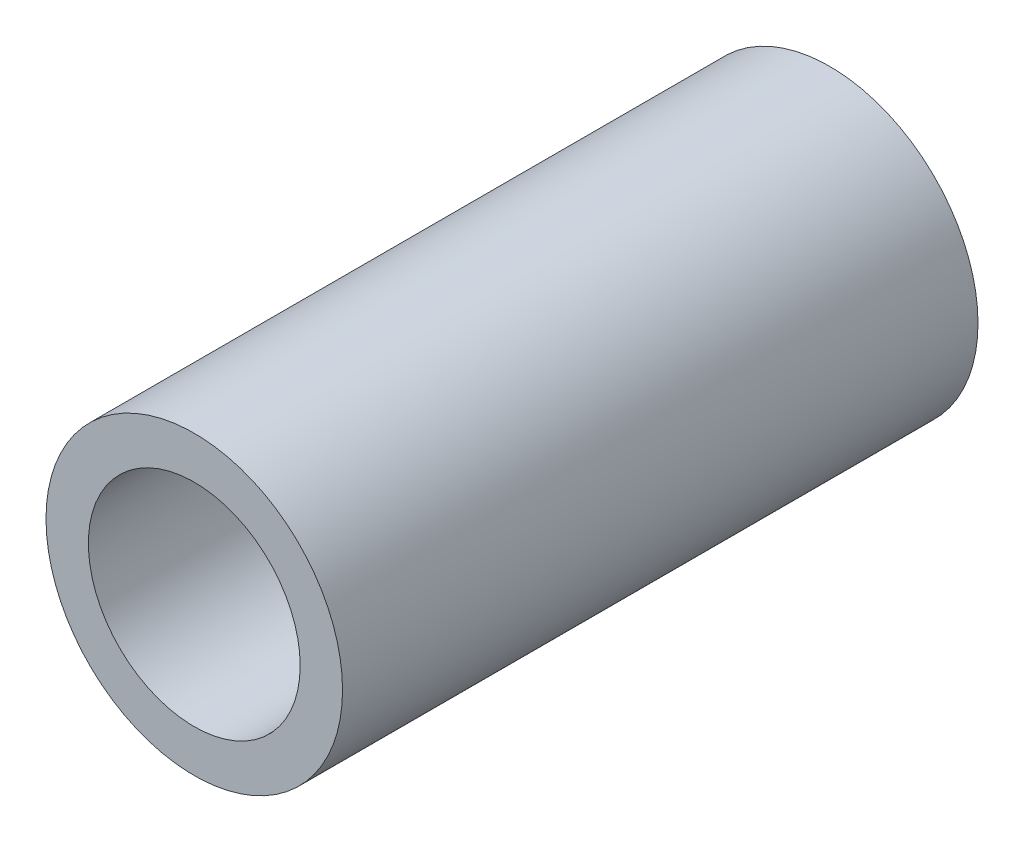
ISO-10303-21;
HEADER;
FILE_DESCRIPTION(('STEP AP214'),'2;1');
FILE_NAME('part.step','',(''),(''),'','','');
FILE_SCHEMA(('AUTOMOTIVE_DESIGN { 1 0 10303 214 1 1 1 1 }'));
ENDSEC;
DATA;
#1=APPLICATION_CONTEXT('core data for automotive mechanical design processes');
#2=APPLICATION_PROTOCOL_DEFINITION('international standard','automotive_design',2000,#1);
#3=PRODUCT_CONTEXT('',#1,'mechanical');
#4=PRODUCT('Part','Part','',(#3));
#5=PRODUCT_RELATED_PRODUCT_CATEGORY('part','',(#4));
#6=PRODUCT_DEFINITION_FORMATION('','',#4);
#7=PRODUCT_DEFINITION_CONTEXT('part definition',#1,'design');
#8=PRODUCT_DEFINITION('design','',#6,#7);
#9=PRODUCT_DEFINITION_SHAPE('','',#8);
#10=(LENGTH_UNIT() NAMED_UNIT(*) SI_UNIT(.MILLI.,.METRE.));
#11=(NAMED_UNIT(*) PLANE_ANGLE_UNIT() SI_UNIT($,.RADIAN.));
#12=(NAMED_UNIT(*) SI_UNIT($,.STERADIAN.) SOLID_ANGLE_UNIT());
#13=UNCERTAINTY_MEASURE_WITH_UNIT(LENGTH_MEASURE(1.E-05),#10,'distance_accuracy_value','');
#14=(GEOMETRIC_REPRESENTATION_CONTEXT(3) GLOBAL_UNCERTAINTY_ASSIGNED_CONTEXT((#13)) GLOBAL_UNIT_ASSIGNED_CONTEXT((#10,
#11,#12)) REPRESENTATION_CONTEXT('',''));
#15=CARTESIAN_POINT('',(0.,0.,0.));
#16=DIRECTION('',(0.,0.,1.));
#17=DIRECTION('',(1.,0.,0.));
#18=AXIS2_PLACEMENT_3D('',#15,#16,#17);
#19=CARTESIAN_POINT('',(0.,0.,15.));
#20=DIRECTION('',(0.,0.,1.));
#21=DIRECTION('',(1.,0.,0.));
#22=AXIS2_PLACEMENT_3D('',#19,#20,#21);
#23=PLANE('',#22);
#24=CARTESIAN_POINT('',(0.,0.,15.));
#25=DIRECTION('',(0.,0.,1.));
#26=DIRECTION('',(1.,0.,0.));
#27=AXIS2_PLACEMENT_3D('',#24,#25,#26);
#28=CIRCLE('',#27,3.5);
#29=CARTESIAN_POINT('',(3.5,0.,15.));
#30=VERTEX_POINT('',#29);
#31=EDGE_CURVE('E10',#30,#30,#28,.T.);
#32=ORIENTED_EDGE('',*,*,#31,.T.);
#33=EDGE_LOOP('',(#32));
#34=FACE_BOUND('',#33,.T.);
#35=CARTESIAN_POINT('',(0.,0.,15.));
#36=DIRECTION('',(0.,0.,1.));
#37=DIRECTION('',(1.,0.,0.));
#38=AXIS2_PLACEMENT_3D('',#35,#36,#37);
#39=CIRCLE('',#38,2.5);
#40=CARTESIAN_POINT('',(2.5,0.,15.));
#41=VERTEX_POINT('',#40);
#42=EDGE_CURVE('E53',#41,#41,#39,.T.);
#43=ORIENTED_EDGE('',*,*,#42,.F.);
#44=EDGE_LOOP('',(#43));
#45=FACE_BOUND('',#44,.T.);
#46=ADVANCED_FACE('F40',(#34,#45),#23,.T.);
#47=CARTESIAN_POINT('',(0.,0.,0.));
#48=DIRECTION('',(0.,0.,1.));
#49=DIRECTION('',(1.,0.,0.));
#50=AXIS2_PLACEMENT_3D('',#47,#48,#49);
#51=PLANE('',#50);
#52=CARTESIAN_POINT('',(0.,0.,0.));
#53=DIRECTION('',(0.,0.,1.));
#54=DIRECTION('',(1.,0.,0.));
#55=AXIS2_PLACEMENT_3D('',#52,#53,#54);
#56=CIRCLE('',#55,3.5);
#57=CARTESIAN_POINT('',(3.5,0.,0.));
#58=VERTEX_POINT('',#57);
#59=EDGE_CURVE('E44',#58,#58,#56,.T.);
#60=ORIENTED_EDGE('',*,*,#59,.F.);
#61=EDGE_LOOP('',(#60));
#62=FACE_BOUND('',#61,.T.);
#63=CARTESIAN_POINT('',(0.,0.,0.));
#64=DIRECTION('',(0.,0.,1.));
#65=DIRECTION('',(1.,0.,0.));
#66=AXIS2_PLACEMENT_3D('',#63,#64,#65);
#67=CIRCLE('',#66,2.5);
#68=CARTESIAN_POINT('',(2.5,0.,0.));
#69=VERTEX_POINT('',#68);
#70=EDGE_CURVE('E55',#69,#69,#67,.T.);
#71=ORIENTED_EDGE('',*,*,#70,.T.);
#72=EDGE_LOOP('',(#71));
#73=FACE_BOUND('',#72,.T.);
#74=ADVANCED_FACE('F67',(#62,#73),#51,.F.);
#75=CARTESIAN_POINT('',(0.,0.,15.));
#76=DIRECTION('',(0.,0.,-1.));
#77=DIRECTION('',(-1.,0.,0.));
#78=AXIS2_PLACEMENT_3D('',#75,#76,#77);
#79=CYLINDRICAL_SURFACE('',#78,3.5);
#80=ORIENTED_EDGE('',*,*,#31,.F.);
#81=EDGE_LOOP('',(#80));
#82=FACE_BOUND('',#81,.T.);
#83=ORIENTED_EDGE('',*,*,#59,.T.);
#84=EDGE_LOOP('',(#83));
#85=FACE_BOUND('',#84,.T.);
#86=ADVANCED_FACE('F42',(#82,#85),#79,.T.);
#87=CARTESIAN_POINT('',(0.,0.,15.));
#88=DIRECTION('',(0.,0.,-1.));
#89=DIRECTION('',(-1.,0.,0.));
#90=AXIS2_PLACEMENT_3D('',#87,#88,#89);
#91=CYLINDRICAL_SURFACE('',#90,2.5);
#92=ORIENTED_EDGE('',*,*,#42,.T.);
#93=EDGE_LOOP('',(#92));
#94=FACE_BOUND('',#93,.T.);
#95=ORIENTED_EDGE('',*,*,#70,.F.);
#96=EDGE_LOOP('',(#95));
#97=FACE_BOUND('',#96,.T.);
#98=ADVANCED_FACE('F63',(#94,#97),#91,.F.);
#99=CLOSED_SHELL('',(#46,#74,#86,#98));
#100=MANIFOLD_SOLID_BREP('B2',#99);
#101=ADVANCED_BREP_SHAPE_REPRESENTATION('',(#18,#100),#14);
#102=SHAPE_DEFINITION_REPRESENTATION(#9,#101);
ENDSEC;
END-ISO-10303-21;
